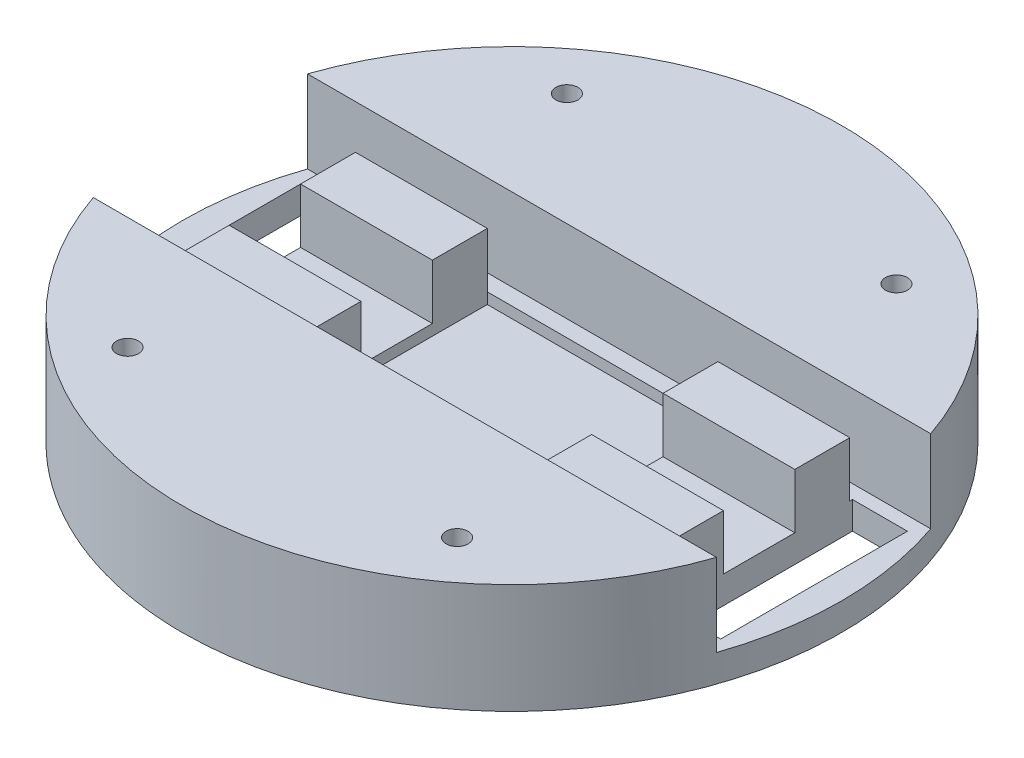
ISO-10303-21;
HEADER;
FILE_DESCRIPTION(('STEP AP214'),'2;1');
FILE_NAME('part.step','',(''),(''),'','','');
FILE_SCHEMA(('AUTOMOTIVE_DESIGN { 1 0 10303 214 1 1 1 1 }'));
ENDSEC;
DATA;
#1=APPLICATION_CONTEXT('core data for automotive mechanical design processes');
#2=APPLICATION_PROTOCOL_DEFINITION('international standard','automotive_design',2000,#1);
#3=PRODUCT_CONTEXT('',#1,'mechanical');
#4=PRODUCT('Part','Part','',(#3));
#5=PRODUCT_RELATED_PRODUCT_CATEGORY('part','',(#4));
#6=PRODUCT_DEFINITION_FORMATION('','',#4);
#7=PRODUCT_DEFINITION_CONTEXT('part definition',#1,'design');
#8=PRODUCT_DEFINITION('design','',#6,#7);
#9=PRODUCT_DEFINITION_SHAPE('','',#8);
#10=(LENGTH_UNIT() NAMED_UNIT(*) SI_UNIT(.MILLI.,.METRE.));
#11=(NAMED_UNIT(*) PLANE_ANGLE_UNIT() SI_UNIT($,.RADIAN.));
#12=(NAMED_UNIT(*) SI_UNIT($,.STERADIAN.) SOLID_ANGLE_UNIT());
#13=UNCERTAINTY_MEASURE_WITH_UNIT(LENGTH_MEASURE(1.E-05),#10,'distance_accuracy_value','');
#14=(GEOMETRIC_REPRESENTATION_CONTEXT(3) GLOBAL_UNCERTAINTY_ASSIGNED_CONTEXT((#13)) GLOBAL_UNIT_ASSIGNED_CONTEXT((#10,
#11,#12)) REPRESENTATION_CONTEXT('',''));
#15=CARTESIAN_POINT('',(0.,0.,0.));
#16=DIRECTION('',(0.,0.,1.));
#17=DIRECTION('',(1.,0.,0.));
#18=AXIS2_PLACEMENT_3D('',#15,#16,#17);
#19=CARTESIAN_POINT('',(0.,5.,0.));
#20=DIRECTION('',(0.,1.,0.));
#21=DIRECTION('',(0.,0.,1.));
#22=AXIS2_PLACEMENT_3D('',#19,#20,#21);
#23=PLANE('',#22);
#24=DIRECTION('',(-1.,0.,0.));
#25=VECTOR('',#24,1.);
#26=CARTESIAN_POINT('',(-21.,5.,-16.5));
#27=LINE('',#26,#25);
#28=CARTESIAN_POINT('',(21.,5.,-16.5));
#29=VERTEX_POINT('',#28);
#30=CARTESIAN_POINT('',(-21.,5.,-16.5));
#31=VERTEX_POINT('',#30);
#32=EDGE_CURVE('E285',#29,#31,#27,.T.);
#33=ORIENTED_EDGE('',*,*,#32,.F.);
#34=DIRECTION('',(-1.,0.,0.));
#35=VECTOR('',#34,1.);
#36=CARTESIAN_POINT('',(45.,5.,-16.5));
#37=LINE('',#36,#35);
#38=CARTESIAN_POINT('',(45.,5.,-16.5));
#39=VERTEX_POINT('',#38);
#40=EDGE_CURVE('E545',#39,#29,#37,.T.);
#41=ORIENTED_EDGE('',*,*,#40,.F.);
#42=DIRECTION('',(0.,0.,1.));
#43=VECTOR('',#42,1.);
#44=CARTESIAN_POINT('',(45.,5.,0.));
#45=LINE('',#44,#43);
#46=CARTESIAN_POINT('',(45.,5.,-17.));
#47=VERTEX_POINT('',#46);
#48=EDGE_CURVE('E450',#47,#39,#45,.T.);
#49=ORIENTED_EDGE('',*,*,#48,.F.);
#50=DIRECTION('',(-1.,0.,0.));
#51=VECTOR('',#50,1.);
#52=CARTESIAN_POINT('',(0.,5.,-16.9999999999999));
#53=LINE('',#52,#51);
#54=CARTESIAN_POINT('',(55.,5.,-17.));
#55=VERTEX_POINT('',#54);
#56=EDGE_CURVE('E461',#55,#47,#53,.T.);
#57=ORIENTED_EDGE('',*,*,#56,.F.);
#58=DIRECTION('',(0.,0.,-1.));
#59=VECTOR('',#58,1.);
#60=CARTESIAN_POINT('',(55.,5.,0.));
#61=LINE('',#60,#59);
#62=CARTESIAN_POINT('',(55.,5.,17.));
#63=VERTEX_POINT('',#62);
#64=EDGE_CURVE('E458',#63,#55,#61,.T.);
#65=ORIENTED_EDGE('',*,*,#64,.F.);
#66=DIRECTION('',(1.,0.,0.));
#67=VECTOR('',#66,1.);
#68=CARTESIAN_POINT('',(0.,5.,17.));
#69=LINE('',#68,#67);
#70=CARTESIAN_POINT('',(45.,5.,17.));
#71=VERTEX_POINT('',#70);
#72=EDGE_CURVE('E454',#71,#63,#69,.T.);
#73=ORIENTED_EDGE('',*,*,#72,.F.);
#74=CARTESIAN_POINT('',(45.,5.,16.5));
#75=VERTEX_POINT('',#74);
#76=EDGE_CURVE('E409',#75,#71,#45,.T.);
#77=ORIENTED_EDGE('',*,*,#76,.F.);
#78=DIRECTION('',(1.,0.,0.));
#79=VECTOR('',#78,1.);
#80=CARTESIAN_POINT('',(45.,5.,16.5));
#81=LINE('',#80,#79);
#82=CARTESIAN_POINT('',(21.,5.,16.5));
#83=VERTEX_POINT('',#82);
#84=EDGE_CURVE('E297',#83,#75,#81,.T.);
#85=ORIENTED_EDGE('',*,*,#84,.F.);
#86=DIRECTION('',(1.,0.,0.));
#87=VECTOR('',#86,1.);
#88=CARTESIAN_POINT('',(-21.,5.,16.5));
#89=LINE('',#88,#87);
#90=CARTESIAN_POINT('',(-21.,5.,16.5));
#91=VERTEX_POINT('',#90);
#92=EDGE_CURVE('E286',#91,#83,#89,.T.);
#93=ORIENTED_EDGE('',*,*,#92,.F.);
#94=DIRECTION('',(1.,0.,0.));
#95=VECTOR('',#94,1.);
#96=CARTESIAN_POINT('',(-45.,5.,16.5));
#97=LINE('',#96,#95);
#98=CARTESIAN_POINT('',(-45.,5.,16.5));
#99=VERTEX_POINT('',#98);
#100=EDGE_CURVE('E349',#99,#91,#97,.T.);
#101=ORIENTED_EDGE('',*,*,#100,.F.);
#102=DIRECTION('',(0.,0.,-1.));
#103=VECTOR('',#102,1.);
#104=CARTESIAN_POINT('',(-45.,5.,0.));
#105=LINE('',#104,#103);
#106=CARTESIAN_POINT('',(-45.,5.,17.));
#107=VERTEX_POINT('',#106);
#108=EDGE_CURVE('E475',#107,#99,#105,.T.);
#109=ORIENTED_EDGE('',*,*,#108,.F.);
#110=DIRECTION('',(1.,0.,0.));
#111=VECTOR('',#110,1.);
#112=CARTESIAN_POINT('',(0.,5.,17.));
#113=LINE('',#112,#111);
#114=CARTESIAN_POINT('',(-55.,5.,17.));
#115=VERTEX_POINT('',#114);
#116=EDGE_CURVE('E471',#115,#107,#113,.T.);
#117=ORIENTED_EDGE('',*,*,#116,.F.);
#118=DIRECTION('',(0.,0.,1.));
#119=VECTOR('',#118,1.);
#120=CARTESIAN_POINT('',(-55.,5.,0.));
#121=LINE('',#120,#119);
#122=CARTESIAN_POINT('',(-55.,5.,-17.));
#123=VERTEX_POINT('',#122);
#124=EDGE_CURVE('E468',#123,#115,#121,.T.);
#125=ORIENTED_EDGE('',*,*,#124,.F.);
#126=DIRECTION('',(-1.,0.,0.));
#127=VECTOR('',#126,1.);
#128=CARTESIAN_POINT('',(0.,5.,-17.));
#129=LINE('',#128,#127);
#130=CARTESIAN_POINT('',(-45.,5.,-17.));
#131=VERTEX_POINT('',#130);
#132=EDGE_CURVE('E465',#131,#123,#129,.T.);
#133=ORIENTED_EDGE('',*,*,#132,.F.);
#134=CARTESIAN_POINT('',(-45.,5.,-16.5));
#135=VERTEX_POINT('',#134);
#136=EDGE_CURVE('E474',#135,#131,#105,.T.);
#137=ORIENTED_EDGE('',*,*,#136,.F.);
#138=DIRECTION('',(-1.,0.,0.));
#139=VECTOR('',#138,1.);
#140=CARTESIAN_POINT('',(-45.,5.,-16.5));
#141=LINE('',#140,#139);
#142=EDGE_CURVE('E320',#31,#135,#141,.T.);
#143=ORIENTED_EDGE('',*,*,#142,.F.);
#144=EDGE_LOOP('',(#33,#41,#49,#57,#65,#73,#77,#85,#93,#101,#109,#117,#125,#133,#137,#143));
#145=FACE_BOUND('',#144,.T.);
#146=CARTESIAN_POINT('',(0.,5.,0.));
#147=DIRECTION('',(0.,1.,0.));
#148=DIRECTION('',(0.,0.,1.));
#149=AXIS2_PLACEMENT_3D('',#146,#147,#148);
#150=CIRCLE('',#149,60.);
#151=CARTESIAN_POINT('',(-56.7428409581332,5.,-19.5));
#152=VERTEX_POINT('',#151);
#153=CARTESIAN_POINT('',(-56.7428409581332,5.,19.5));
#154=VERTEX_POINT('',#153);
#155=EDGE_CURVE('E11',#152,#154,#150,.T.);
#156=ORIENTED_EDGE('',*,*,#155,.T.);
#157=DIRECTION('',(-1.,0.,0.));
#158=VECTOR('',#157,1.);
#159=CARTESIAN_POINT('',(-56.7428409581332,5.,19.5));
#160=LINE('',#159,#158);
#161=CARTESIAN_POINT('',(56.7428409581332,5.,19.5));
#162=VERTEX_POINT('',#161);
#163=EDGE_CURVE('E678',#162,#154,#160,.T.);
#164=ORIENTED_EDGE('',*,*,#163,.F.);
#165=CARTESIAN_POINT('',(56.7428409581332,5.,-19.5));
#166=VERTEX_POINT('',#165);
#167=EDGE_CURVE('E49',#162,#166,#150,.T.);
#168=ORIENTED_EDGE('',*,*,#167,.T.);
#169=DIRECTION('',(1.,0.,0.));
#170=VECTOR('',#169,1.);
#171=CARTESIAN_POINT('',(-56.7428409581332,5.,-19.5));
#172=LINE('',#171,#170);
#173=EDGE_CURVE('E659',#152,#166,#172,.T.);
#174=ORIENTED_EDGE('',*,*,#173,.F.);
#175=EDGE_LOOP('',(#156,#164,#168,#174));
#176=FACE_BOUND('',#175,.T.);
#177=ADVANCED_FACE('F39',(#145,#176),#23,.T.);
#178=DIRECTION('',(0.,0.,1.));
#179=VECTOR('',#178,1.);
#180=CARTESIAN_POINT('',(-21.,5.,-16.5));
#181=LINE('',#180,#179);
#182=CARTESIAN_POINT('',(-21.,5.,-6.5));
#183=VERTEX_POINT('',#182);
#184=CARTESIAN_POINT('',(-21.,5.,6.5));
#185=VERTEX_POINT('',#184);
#186=EDGE_CURVE('E530',#183,#185,#181,.T.);
#187=ORIENTED_EDGE('',*,*,#186,.F.);
#188=DIRECTION('',(1.,0.,0.));
#189=VECTOR('',#188,1.);
#190=CARTESIAN_POINT('',(-45.,5.,-6.5));
#191=LINE('',#190,#189);
#192=CARTESIAN_POINT('',(-45.,5.,-6.5));
#193=VERTEX_POINT('',#192);
#194=EDGE_CURVE('E308',#193,#183,#191,.T.);
#195=ORIENTED_EDGE('',*,*,#194,.F.);
#196=CARTESIAN_POINT('',(-45.,5.,6.5));
#197=VERTEX_POINT('',#196);
#198=EDGE_CURVE('E478',#197,#193,#105,.T.);
#199=ORIENTED_EDGE('',*,*,#198,.F.);
#200=DIRECTION('',(-1.,0.,0.));
#201=VECTOR('',#200,1.);
#202=CARTESIAN_POINT('',(-45.,5.,6.5));
#203=LINE('',#202,#201);
#204=EDGE_CURVE('E355',#185,#197,#203,.T.);
#205=ORIENTED_EDGE('',*,*,#204,.F.);
#206=EDGE_LOOP('',(#187,#195,#199,#205));
#207=FACE_BOUND('',#206,.T.);
#208=ADVANCED_FACE('F252',(#207),#23,.T.);
#209=DIRECTION('',(0.,0.,-1.));
#210=VECTOR('',#209,1.);
#211=CARTESIAN_POINT('',(21.,5.,-16.5));
#212=LINE('',#211,#210);
#213=CARTESIAN_POINT('',(21.,5.,6.5));
#214=VERTEX_POINT('',#213);
#215=CARTESIAN_POINT('',(21.,5.,-6.5));
#216=VERTEX_POINT('',#215);
#217=EDGE_CURVE('E274',#214,#216,#212,.T.);
#218=ORIENTED_EDGE('',*,*,#217,.F.);
#219=DIRECTION('',(-1.,0.,0.));
#220=VECTOR('',#219,1.);
#221=CARTESIAN_POINT('',(45.,5.,6.49999999999999));
#222=LINE('',#221,#220);
#223=CARTESIAN_POINT('',(45.,5.,6.49999999999999));
#224=VERTEX_POINT('',#223);
#225=EDGE_CURVE('E277',#224,#214,#222,.T.);
#226=ORIENTED_EDGE('',*,*,#225,.F.);
#227=CARTESIAN_POINT('',(45.,5.,-6.49999999999999));
#228=VERTEX_POINT('',#227);
#229=EDGE_CURVE('E455',#228,#224,#45,.T.);
#230=ORIENTED_EDGE('',*,*,#229,.F.);
#231=DIRECTION('',(1.,0.,0.));
#232=VECTOR('',#231,1.);
#233=CARTESIAN_POINT('',(45.,5.,-6.49999999999999));
#234=LINE('',#233,#232);
#235=EDGE_CURVE('E279',#216,#228,#234,.T.);
#236=ORIENTED_EDGE('',*,*,#235,.F.);
#237=EDGE_LOOP('',(#218,#226,#230,#236));
#238=FACE_BOUND('',#237,.T.);
#239=ADVANCED_FACE('F255',(#238),#23,.T.);
#240=CARTESIAN_POINT('',(0.,5.,0.));
#241=DIRECTION('',(0.,-1.,0.));
#242=DIRECTION('',(0.,0.,-1.));
#243=AXIS2_PLACEMENT_3D('',#240,#241,#242);
#244=CYLINDRICAL_SURFACE('',#243,60.);
#245=ORIENTED_EDGE('',*,*,#155,.F.);
#246=DIRECTION('',(0.,-1.,0.));
#247=VECTOR('',#246,1.);
#248=CARTESIAN_POINT('',(-56.7428409581332,20.,-19.5));
#249=LINE('',#248,#247);
#250=CARTESIAN_POINT('',(-56.7428409581332,20.,-19.5));
#251=VERTEX_POINT('',#250);
#252=EDGE_CURVE('E637',#251,#152,#249,.T.);
#253=ORIENTED_EDGE('',*,*,#252,.F.);
#254=CARTESIAN_POINT('',(0.,20.,0.));
#255=DIRECTION('',(0.,1.,0.));
#256=DIRECTION('',(0.,0.,-1.));
#257=AXIS2_PLACEMENT_3D('',#254,#255,#256);
#258=CIRCLE('',#257,60.);
#259=CARTESIAN_POINT('',(56.7428409581332,20.,-19.5));
#260=VERTEX_POINT('',#259);
#261=EDGE_CURVE('E663',#260,#251,#258,.T.);
#262=ORIENTED_EDGE('',*,*,#261,.F.);
#263=DIRECTION('',(0.,-1.,0.));
#264=VECTOR('',#263,1.);
#265=CARTESIAN_POINT('',(56.7428409581332,20.,-19.5));
#266=LINE('',#265,#264);
#267=EDGE_CURVE('E654',#260,#166,#266,.T.);
#268=ORIENTED_EDGE('',*,*,#267,.T.);
#269=ORIENTED_EDGE('',*,*,#167,.F.);
#270=DIRECTION('',(0.,-1.,0.));
#271=VECTOR('',#270,1.);
#272=CARTESIAN_POINT('',(56.7428409581332,20.,19.5));
#273=LINE('',#272,#271);
#274=CARTESIAN_POINT('',(56.7428409581332,20.,19.5));
#275=VERTEX_POINT('',#274);
#276=EDGE_CURVE('E664',#275,#162,#273,.T.);
#277=ORIENTED_EDGE('',*,*,#276,.F.);
#278=CARTESIAN_POINT('',(0.,20.,0.));
#279=DIRECTION('',(0.,1.,0.));
#280=DIRECTION('',(0.,0.,1.));
#281=AXIS2_PLACEMENT_3D('',#278,#279,#280);
#282=CIRCLE('',#281,60.);
#283=CARTESIAN_POINT('',(-56.7428409581332,20.,19.5));
#284=VERTEX_POINT('',#283);
#285=EDGE_CURVE('E681',#284,#275,#282,.T.);
#286=ORIENTED_EDGE('',*,*,#285,.F.);
#287=DIRECTION('',(0.,-1.,0.));
#288=VECTOR('',#287,1.);
#289=CARTESIAN_POINT('',(-56.7428409581332,20.,19.5));
#290=LINE('',#289,#288);
#291=EDGE_CURVE('E673',#284,#154,#290,.T.);
#292=ORIENTED_EDGE('',*,*,#291,.T.);
#293=EDGE_LOOP('',(#245,#253,#262,#268,#269,#277,#286,#292));
#294=FACE_BOUND('',#293,.T.);
#295=CARTESIAN_POINT('',(0.,0.,0.));
#296=DIRECTION('',(0.,1.,0.));
#297=DIRECTION('',(0.,0.,1.));
#298=AXIS2_PLACEMENT_3D('',#295,#296,#297);
#299=CIRCLE('',#298,60.);
#300=CARTESIAN_POINT('',(0.,0.,60.));
#301=VERTEX_POINT('',#300);
#302=EDGE_CURVE('E43',#301,#301,#299,.T.);
#303=ORIENTED_EDGE('',*,*,#302,.T.);
#304=EDGE_LOOP('',(#303));
#305=FACE_BOUND('',#304,.T.);
#306=ADVANCED_FACE('F41',(#294,#305),#244,.T.);
#307=CARTESIAN_POINT('',(0.,0.,0.));
#308=DIRECTION('',(0.,1.,0.));
#309=DIRECTION('',(0.,0.,1.));
#310=AXIS2_PLACEMENT_3D('',#307,#308,#309);
#311=PLANE('',#310);
#312=DIRECTION('',(1.,0.,0.));
#313=VECTOR('',#312,1.);
#314=CARTESIAN_POINT('',(-45.,0.,17.));
#315=LINE('',#314,#313);
#316=CARTESIAN_POINT('',(-55.,0.,17.));
#317=VERTEX_POINT('',#316);
#318=CARTESIAN_POINT('',(-45.,0.,17.));
#319=VERTEX_POINT('',#318);
#320=EDGE_CURVE('E400',#317,#319,#315,.T.);
#321=ORIENTED_EDGE('',*,*,#320,.T.);
#322=DIRECTION('',(0.,0.,-1.));
#323=VECTOR('',#322,1.);
#324=CARTESIAN_POINT('',(-45.,0.,-17.));
#325=LINE('',#324,#323);
#326=CARTESIAN_POINT('',(-45.,0.,-17.));
#327=VERTEX_POINT('',#326);
#328=EDGE_CURVE('E387',#319,#327,#325,.T.);
#329=ORIENTED_EDGE('',*,*,#328,.T.);
#330=DIRECTION('',(-1.,0.,0.));
#331=VECTOR('',#330,1.);
#332=CARTESIAN_POINT('',(-45.,0.,-17.));
#333=LINE('',#332,#331);
#334=CARTESIAN_POINT('',(-55.,0.,-17.));
#335=VERTEX_POINT('',#334);
#336=EDGE_CURVE('E391',#327,#335,#333,.T.);
#337=ORIENTED_EDGE('',*,*,#336,.T.);
#338=DIRECTION('',(0.,0.,1.));
#339=VECTOR('',#338,1.);
#340=CARTESIAN_POINT('',(-55.,0.,-17.));
#341=LINE('',#340,#339);
#342=EDGE_CURVE('E396',#335,#317,#341,.T.);
#343=ORIENTED_EDGE('',*,*,#342,.T.);
#344=EDGE_LOOP('',(#321,#329,#337,#343));
#345=FACE_BOUND('',#344,.T.);
#346=DIRECTION('',(0.,0.,-1.));
#347=VECTOR('',#346,1.);
#348=CARTESIAN_POINT('',(55.,0.,-17.));
#349=LINE('',#348,#347);
#350=CARTESIAN_POINT('',(55.,0.,17.));
#351=VERTEX_POINT('',#350);
#352=CARTESIAN_POINT('',(55.,0.,-17.));
#353=VERTEX_POINT('',#352);
#354=EDGE_CURVE('E432',#351,#353,#349,.T.);
#355=ORIENTED_EDGE('',*,*,#354,.T.);
#356=DIRECTION('',(-1.,0.,0.));
#357=VECTOR('',#356,1.);
#358=CARTESIAN_POINT('',(45.,0.,-17.));
#359=LINE('',#358,#357);
#360=CARTESIAN_POINT('',(45.,0.,-17.));
#361=VERTEX_POINT('',#360);
#362=EDGE_CURVE('E386',#353,#361,#359,.T.);
#363=ORIENTED_EDGE('',*,*,#362,.T.);
#364=DIRECTION('',(0.,0.,1.));
#365=VECTOR('',#364,1.);
#366=CARTESIAN_POINT('',(45.,0.,-17.));
#367=LINE('',#366,#365);
#368=CARTESIAN_POINT('',(45.,0.,17.));
#369=VERTEX_POINT('',#368);
#370=EDGE_CURVE('E424',#361,#369,#367,.T.);
#371=ORIENTED_EDGE('',*,*,#370,.T.);
#372=DIRECTION('',(1.,0.,0.));
#373=VECTOR('',#372,1.);
#374=CARTESIAN_POINT('',(45.,0.,17.));
#375=LINE('',#374,#373);
#376=EDGE_CURVE('E428',#369,#351,#375,.T.);
#377=ORIENTED_EDGE('',*,*,#376,.T.);
#378=EDGE_LOOP('',(#355,#363,#371,#377));
#379=FACE_BOUND('',#378,.T.);
#380=ORIENTED_EDGE('',*,*,#302,.F.);
#381=CARTESIAN_POINT('',(0.,0.,39.75));
#382=DIRECTION('',(0.,1.,0.));
#383=DIRECTION('',(0.,0.,1.));
#384=AXIS2_PLACEMENT_3D('',#381,#382,#383);
#385=CIRCLE('',#384,20.25);
#386=EDGE_CURVE('E54',#301,#301,#385,.T.);
#387=ORIENTED_EDGE('',*,*,#386,.T.);
#388=EDGE_LOOP('',(#380,#387));
#389=FACE_BOUND('',#388,.T.);
#390=ADVANCED_FACE('F270',(#345,#379,#389),#311,.F.);
#391=CARTESIAN_POINT('',(45.,0.,-17.));
#392=DIRECTION('',(0.,0.,-1.));
#393=DIRECTION('',(-1.,0.,0.));
#394=AXIS2_PLACEMENT_3D('',#391,#392,#393);
#395=PLANE('',#394);
#396=ORIENTED_EDGE('',*,*,#56,.T.);
#397=DIRECTION('',(0.,1.,0.));
#398=VECTOR('',#397,1.);
#399=CARTESIAN_POINT('',(45.,0.,-17.));
#400=LINE('',#399,#398);
#401=EDGE_CURVE('E436',#361,#47,#400,.T.);
#402=ORIENTED_EDGE('',*,*,#401,.F.);
#403=ORIENTED_EDGE('',*,*,#362,.F.);
#404=DIRECTION('',(0.,1.,0.));
#405=VECTOR('',#404,1.);
#406=CARTESIAN_POINT('',(55.,0.,-17.));
#407=LINE('',#406,#405);
#408=EDGE_CURVE('E392',#353,#55,#407,.T.);
#409=ORIENTED_EDGE('',*,*,#408,.T.);
#410=EDGE_LOOP('',(#396,#402,#403,#409));
#411=FACE_BOUND('',#410,.T.);
#412=ADVANCED_FACE('F724',(#411),#395,.F.);
#413=CARTESIAN_POINT('',(55.,0.,-17.));
#414=DIRECTION('',(1.,0.,0.));
#415=DIRECTION('',(0.,0.,-1.));
#416=AXIS2_PLACEMENT_3D('',#413,#414,#415);
#417=PLANE('',#416);
#418=ORIENTED_EDGE('',*,*,#64,.T.);
#419=ORIENTED_EDGE('',*,*,#408,.F.);
#420=ORIENTED_EDGE('',*,*,#354,.F.);
#421=DIRECTION('',(0.,1.,0.));
#422=VECTOR('',#421,1.);
#423=CARTESIAN_POINT('',(55.,0.,17.));
#424=LINE('',#423,#422);
#425=EDGE_CURVE('E440',#351,#63,#424,.T.);
#426=ORIENTED_EDGE('',*,*,#425,.T.);
#427=EDGE_LOOP('',(#418,#419,#420,#426));
#428=FACE_BOUND('',#427,.T.);
#429=ADVANCED_FACE('F727',(#428),#417,.F.);
#430=CARTESIAN_POINT('',(45.,0.,17.));
#431=DIRECTION('',(0.,0.,1.));
#432=DIRECTION('',(1.,0.,0.));
#433=AXIS2_PLACEMENT_3D('',#430,#431,#432);
#434=PLANE('',#433);
#435=ORIENTED_EDGE('',*,*,#72,.T.);
#436=ORIENTED_EDGE('',*,*,#425,.F.);
#437=ORIENTED_EDGE('',*,*,#376,.F.);
#438=DIRECTION('',(0.,1.,0.));
#439=VECTOR('',#438,1.);
#440=CARTESIAN_POINT('',(45.,0.,17.));
#441=LINE('',#440,#439);
#442=EDGE_CURVE('E444',#369,#71,#441,.T.);
#443=ORIENTED_EDGE('',*,*,#442,.T.);
#444=EDGE_LOOP('',(#435,#436,#437,#443));
#445=FACE_BOUND('',#444,.T.);
#446=ADVANCED_FACE('F732',(#445),#434,.F.);
#447=CARTESIAN_POINT('',(45.,0.,-17.));
#448=DIRECTION('',(-1.,0.,0.));
#449=DIRECTION('',(0.,0.,1.));
#450=AXIS2_PLACEMENT_3D('',#447,#448,#449);
#451=PLANE('',#450);
#452=ORIENTED_EDGE('',*,*,#48,.T.);
#453=DIRECTION('',(0.,-1.,0.));
#454=VECTOR('',#453,1.);
#455=CARTESIAN_POINT('',(45.,15.,-16.5));
#456=LINE('',#455,#454);
#457=CARTESIAN_POINT('',(45.,15.,-16.5));
#458=VERTEX_POINT('',#457);
#459=EDGE_CURVE('E298',#458,#39,#456,.T.);
#460=ORIENTED_EDGE('',*,*,#459,.F.);
#461=DIRECTION('',(0.,0.,-1.));
#462=VECTOR('',#461,1.);
#463=CARTESIAN_POINT('',(45.,15.,-16.5));
#464=LINE('',#463,#462);
#465=CARTESIAN_POINT('',(45.,15.,-6.49999999999999));
#466=VERTEX_POINT('',#465);
#467=EDGE_CURVE('E605',#466,#458,#464,.T.);
#468=ORIENTED_EDGE('',*,*,#467,.F.);
#469=DIRECTION('',(0.,-1.,0.));
#470=VECTOR('',#469,1.);
#471=CARTESIAN_POINT('',(45.,15.,-6.49999999999999));
#472=LINE('',#471,#470);
#473=EDGE_CURVE('E570',#466,#228,#472,.T.);
#474=ORIENTED_EDGE('',*,*,#473,.T.);
#475=ORIENTED_EDGE('',*,*,#229,.T.);
#476=DIRECTION('',(0.,-1.,0.));
#477=VECTOR('',#476,1.);
#478=CARTESIAN_POINT('',(45.,15.,6.49999999999999));
#479=LINE('',#478,#477);
#480=CARTESIAN_POINT('',(45.,15.,6.49999999999999));
#481=VERTEX_POINT('',#480);
#482=EDGE_CURVE('E295',#481,#224,#479,.T.);
#483=ORIENTED_EDGE('',*,*,#482,.F.);
#484=DIRECTION('',(0.,0.,-1.));
#485=VECTOR('',#484,1.);
#486=CARTESIAN_POINT('',(45.,15.,6.49999999999999));
#487=LINE('',#486,#485);
#488=CARTESIAN_POINT('',(45.,15.,16.5));
#489=VERTEX_POINT('',#488);
#490=EDGE_CURVE('E574',#489,#481,#487,.T.);
#491=ORIENTED_EDGE('',*,*,#490,.F.);
#492=DIRECTION('',(0.,-1.,0.));
#493=VECTOR('',#492,1.);
#494=CARTESIAN_POINT('',(45.,15.,16.5));
#495=LINE('',#494,#493);
#496=EDGE_CURVE('E311',#489,#75,#495,.T.);
#497=ORIENTED_EDGE('',*,*,#496,.T.);
#498=ORIENTED_EDGE('',*,*,#76,.T.);
#499=ORIENTED_EDGE('',*,*,#442,.F.);
#500=ORIENTED_EDGE('',*,*,#370,.F.);
#501=ORIENTED_EDGE('',*,*,#401,.T.);
#502=EDGE_LOOP('',(#452,#460,#468,#474,#475,#483,#491,#497,#498,#499,#500,#501));
#503=FACE_BOUND('',#502,.T.);
#504=ADVANCED_FACE('F592',(#503),#451,.F.);
#505=CARTESIAN_POINT('',(-45.,0.,-17.));
#506=DIRECTION('',(1.,0.,0.));
#507=DIRECTION('',(0.,0.,-1.));
#508=AXIS2_PLACEMENT_3D('',#505,#506,#507);
#509=PLANE('',#508);
#510=ORIENTED_EDGE('',*,*,#108,.T.);
#511=DIRECTION('',(0.,-1.,0.));
#512=VECTOR('',#511,1.);
#513=CARTESIAN_POINT('',(-45.,15.,16.5));
#514=LINE('',#513,#512);
#515=CARTESIAN_POINT('',(-45.,15.,16.5));
#516=VERTEX_POINT('',#515);
#517=EDGE_CURVE('E382',#516,#99,#514,.T.);
#518=ORIENTED_EDGE('',*,*,#517,.F.);
#519=DIRECTION('',(0.,0.,1.));
#520=VECTOR('',#519,1.);
#521=CARTESIAN_POINT('',(-45.,15.,6.5));
#522=LINE('',#521,#520);
#523=CARTESIAN_POINT('',(-45.,15.,6.5));
#524=VERTEX_POINT('',#523);
#525=EDGE_CURVE('E350',#524,#516,#522,.T.);
#526=ORIENTED_EDGE('',*,*,#525,.F.);
#527=DIRECTION('',(0.,-1.,0.));
#528=VECTOR('',#527,1.);
#529=CARTESIAN_POINT('',(-45.,15.,6.5));
#530=LINE('',#529,#528);
#531=EDGE_CURVE('E364',#524,#197,#530,.T.);
#532=ORIENTED_EDGE('',*,*,#531,.T.);
#533=ORIENTED_EDGE('',*,*,#198,.T.);
#534=DIRECTION('',(0.,-1.,0.));
#535=VECTOR('',#534,1.);
#536=CARTESIAN_POINT('',(-45.,15.,-6.5));
#537=LINE('',#536,#535);
#538=CARTESIAN_POINT('',(-45.,15.,-6.5));
#539=VERTEX_POINT('',#538);
#540=EDGE_CURVE('E346',#539,#193,#537,.T.);
#541=ORIENTED_EDGE('',*,*,#540,.F.);
#542=DIRECTION('',(0.,0.,1.));
#543=VECTOR('',#542,1.);
#544=CARTESIAN_POINT('',(-45.,15.,-16.5));
#545=LINE('',#544,#543);
#546=CARTESIAN_POINT('',(-45.,15.,-16.5));
#547=VERTEX_POINT('',#546);
#548=EDGE_CURVE('E315',#547,#539,#545,.T.);
#549=ORIENTED_EDGE('',*,*,#548,.F.);
#550=DIRECTION('',(0.,-1.,0.));
#551=VECTOR('',#550,1.);
#552=CARTESIAN_POINT('',(-45.,15.,-16.5));
#553=LINE('',#552,#551);
#554=EDGE_CURVE('E329',#547,#135,#553,.T.);
#555=ORIENTED_EDGE('',*,*,#554,.T.);
#556=ORIENTED_EDGE('',*,*,#136,.T.);
#557=DIRECTION('',(0.,1.,0.));
#558=VECTOR('',#557,1.);
#559=CARTESIAN_POINT('',(-45.,0.,-17.));
#560=LINE('',#559,#558);
#561=EDGE_CURVE('E404',#327,#131,#560,.T.);
#562=ORIENTED_EDGE('',*,*,#561,.F.);
#563=ORIENTED_EDGE('',*,*,#328,.F.);
#564=DIRECTION('',(0.,1.,0.));
#565=VECTOR('',#564,1.);
#566=CARTESIAN_POINT('',(-45.,0.,17.));
#567=LINE('',#566,#565);
#568=EDGE_CURVE('E405',#319,#107,#567,.T.);
#569=ORIENTED_EDGE('',*,*,#568,.T.);
#570=EDGE_LOOP('',(#510,#518,#526,#532,#533,#541,#549,#555,#556,#562,#563,#569));
#571=FACE_BOUND('',#570,.T.);
#572=ADVANCED_FACE('F488',(#571),#509,.F.);
#573=CARTESIAN_POINT('',(-45.,0.,17.));
#574=DIRECTION('',(0.,0.,1.));
#575=DIRECTION('',(1.,0.,0.));
#576=AXIS2_PLACEMENT_3D('',#573,#574,#575);
#577=PLANE('',#576);
#578=ORIENTED_EDGE('',*,*,#116,.T.);
#579=ORIENTED_EDGE('',*,*,#568,.F.);
#580=ORIENTED_EDGE('',*,*,#320,.F.);
#581=DIRECTION('',(0.,1.,0.));
#582=VECTOR('',#581,1.);
#583=CARTESIAN_POINT('',(-55.,0.,17.));
#584=LINE('',#583,#582);
#585=EDGE_CURVE('E410',#317,#115,#584,.T.);
#586=ORIENTED_EDGE('',*,*,#585,.T.);
#587=EDGE_LOOP('',(#578,#579,#580,#586));
#588=FACE_BOUND('',#587,.T.);
#589=ADVANCED_FACE('F504',(#588),#577,.F.);
#590=CARTESIAN_POINT('',(-55.,0.,-17.));
#591=DIRECTION('',(-1.,0.,0.));
#592=DIRECTION('',(0.,0.,1.));
#593=AXIS2_PLACEMENT_3D('',#590,#591,#592);
#594=PLANE('',#593);
#595=ORIENTED_EDGE('',*,*,#124,.T.);
#596=ORIENTED_EDGE('',*,*,#585,.F.);
#597=ORIENTED_EDGE('',*,*,#342,.F.);
#598=DIRECTION('',(0.,1.,0.));
#599=VECTOR('',#598,1.);
#600=CARTESIAN_POINT('',(-55.,0.,-17.));
#601=LINE('',#600,#599);
#602=EDGE_CURVE('E414',#335,#123,#601,.T.);
#603=ORIENTED_EDGE('',*,*,#602,.T.);
#604=EDGE_LOOP('',(#595,#596,#597,#603));
#605=FACE_BOUND('',#604,.T.);
#606=ADVANCED_FACE('F501',(#605),#594,.F.);
#607=CARTESIAN_POINT('',(-45.,0.,-17.));
#608=DIRECTION('',(0.,0.,-1.));
#609=DIRECTION('',(-1.,0.,0.));
#610=AXIS2_PLACEMENT_3D('',#607,#608,#609);
#611=PLANE('',#610);
#612=ORIENTED_EDGE('',*,*,#132,.T.);
#613=ORIENTED_EDGE('',*,*,#602,.F.);
#614=ORIENTED_EDGE('',*,*,#336,.F.);
#615=ORIENTED_EDGE('',*,*,#561,.T.);
#616=EDGE_LOOP('',(#612,#613,#614,#615));
#617=FACE_BOUND('',#616,.T.);
#618=ADVANCED_FACE('F496',(#617),#611,.F.);
#619=CARTESIAN_POINT('',(-45.,15.,16.5));
#620=DIRECTION('',(0.,0.,-1.));
#621=DIRECTION('',(-1.,0.,0.));
#622=AXIS2_PLACEMENT_3D('',#619,#620,#621);
#623=PLANE('',#622);
#624=ORIENTED_EDGE('',*,*,#100,.T.);
#625=DIRECTION('',(0.,-1.,0.));
#626=VECTOR('',#625,1.);
#627=CARTESIAN_POINT('',(-21.,15.,16.5));
#628=LINE('',#627,#626);
#629=CARTESIAN_POINT('',(-21.,15.,16.5));
#630=VERTEX_POINT('',#629);
#631=EDGE_CURVE('E378',#630,#91,#628,.T.);
#632=ORIENTED_EDGE('',*,*,#631,.F.);
#633=DIRECTION('',(1.,0.,0.));
#634=VECTOR('',#633,1.);
#635=CARTESIAN_POINT('',(-45.,15.,16.5));
#636=LINE('',#635,#634);
#637=EDGE_CURVE('E354',#516,#630,#636,.T.);
#638=ORIENTED_EDGE('',*,*,#637,.F.);
#639=ORIENTED_EDGE('',*,*,#517,.T.);
#640=EDGE_LOOP('',(#624,#632,#638,#639));
#641=FACE_BOUND('',#640,.T.);
#642=ADVANCED_FACE('F512',(#641),#623,.F.);
#643=CARTESIAN_POINT('',(-21.,15.,6.5));
#644=DIRECTION('',(-1.,0.,0.));
#645=DIRECTION('',(0.,0.,1.));
#646=AXIS2_PLACEMENT_3D('',#643,#644,#645);
#647=PLANE('',#646);
#648=ORIENTED_EDGE('',*,*,#631,.T.);
#649=DIRECTION('',(0.,1.,0.));
#650=VECTOR('',#649,1.);
#651=CARTESIAN_POINT('',(-21.,3.,16.5));
#652=LINE('',#651,#650);
#653=CARTESIAN_POINT('',(-21.,3.,16.5));
#654=VERTEX_POINT('',#653);
#655=EDGE_CURVE('E517',#654,#91,#652,.T.);
#656=ORIENTED_EDGE('',*,*,#655,.F.);
#657=DIRECTION('',(0.,0.,1.));
#658=VECTOR('',#657,1.);
#659=CARTESIAN_POINT('',(-21.,3.,-16.5));
#660=LINE('',#659,#658);
#661=CARTESIAN_POINT('',(-21.,3.,-16.5));
#662=VERTEX_POINT('',#661);
#663=EDGE_CURVE('E548',#662,#654,#660,.T.);
#664=ORIENTED_EDGE('',*,*,#663,.F.);
#665=DIRECTION('',(0.,1.,0.));
#666=VECTOR('',#665,1.);
#667=CARTESIAN_POINT('',(-21.,3.,-16.5));
#668=LINE('',#667,#666);
#669=EDGE_CURVE('E558',#662,#31,#668,.T.);
#670=ORIENTED_EDGE('',*,*,#669,.T.);
#671=DIRECTION('',(0.,-1.,0.));
#672=VECTOR('',#671,1.);
#673=CARTESIAN_POINT('',(-21.,15.,-16.5));
#674=LINE('',#673,#672);
#675=CARTESIAN_POINT('',(-21.,15.,-16.5));
#676=VERTEX_POINT('',#675);
#677=EDGE_CURVE('E338',#676,#31,#674,.T.);
#678=ORIENTED_EDGE('',*,*,#677,.F.);
#679=DIRECTION('',(0.,0.,-1.));
#680=VECTOR('',#679,1.);
#681=CARTESIAN_POINT('',(-21.,15.,-16.5));
#682=LINE('',#681,#680);
#683=CARTESIAN_POINT('',(-21.,15.,-6.5));
#684=VERTEX_POINT('',#683);
#685=EDGE_CURVE('E323',#684,#676,#682,.T.);
#686=ORIENTED_EDGE('',*,*,#685,.F.);
#687=DIRECTION('',(0.,-1.,0.));
#688=VECTOR('',#687,1.);
#689=CARTESIAN_POINT('',(-21.,15.,-6.5));
#690=LINE('',#689,#688);
#691=EDGE_CURVE('E342',#684,#183,#690,.T.);
#692=ORIENTED_EDGE('',*,*,#691,.T.);
#693=ORIENTED_EDGE('',*,*,#186,.T.);
#694=DIRECTION('',(0.,-1.,0.));
#695=VECTOR('',#694,1.);
#696=CARTESIAN_POINT('',(-21.,15.,6.5));
#697=LINE('',#696,#695);
#698=CARTESIAN_POINT('',(-21.,15.,6.5));
#699=VERTEX_POINT('',#698);
#700=EDGE_CURVE('E374',#699,#185,#697,.T.);
#701=ORIENTED_EDGE('',*,*,#700,.F.);
#702=DIRECTION('',(0.,0.,-1.));
#703=VECTOR('',#702,1.);
#704=CARTESIAN_POINT('',(-21.,15.,6.5));
#705=LINE('',#704,#703);
#706=EDGE_CURVE('E358',#630,#699,#705,.T.);
#707=ORIENTED_EDGE('',*,*,#706,.F.);
#708=EDGE_LOOP('',(#648,#656,#664,#670,#678,#686,#692,#693,#701,#707));
#709=FACE_BOUND('',#708,.T.);
#710=ADVANCED_FACE('F515',(#709),#647,.F.);
#711=CARTESIAN_POINT('',(-45.,15.,6.5));
#712=DIRECTION('',(0.,0.,1.));
#713=DIRECTION('',(1.,0.,0.));
#714=AXIS2_PLACEMENT_3D('',#711,#712,#713);
#715=PLANE('',#714);
#716=ORIENTED_EDGE('',*,*,#204,.T.);
#717=ORIENTED_EDGE('',*,*,#531,.F.);
#718=DIRECTION('',(-1.,0.,0.));
#719=VECTOR('',#718,1.);
#720=CARTESIAN_POINT('',(-45.,15.,6.5));
#721=LINE('',#720,#719);
#722=EDGE_CURVE('E361',#699,#524,#721,.T.);
#723=ORIENTED_EDGE('',*,*,#722,.F.);
#724=ORIENTED_EDGE('',*,*,#700,.T.);
#725=EDGE_LOOP('',(#716,#717,#723,#724));
#726=FACE_BOUND('',#725,.T.);
#727=ADVANCED_FACE('F527',(#726),#715,.F.);
#728=CARTESIAN_POINT('',(0.,15.,0.));
#729=DIRECTION('',(0.,1.,0.));
#730=DIRECTION('',(0.,0.,1.));
#731=AXIS2_PLACEMENT_3D('',#728,#729,#730);
#732=PLANE('',#731);
#733=ORIENTED_EDGE('',*,*,#525,.T.);
#734=ORIENTED_EDGE('',*,*,#637,.T.);
#735=ORIENTED_EDGE('',*,*,#706,.T.);
#736=ORIENTED_EDGE('',*,*,#722,.T.);
#737=EDGE_LOOP('',(#733,#734,#735,#736));
#738=FACE_BOUND('',#737,.T.);
#739=ADVANCED_FACE('F522',(#738),#732,.T.);
#740=CARTESIAN_POINT('',(-45.,15.,-6.5));
#741=DIRECTION('',(0.,0.,-1.));
#742=DIRECTION('',(-1.,0.,0.));
#743=AXIS2_PLACEMENT_3D('',#740,#741,#742);
#744=PLANE('',#743);
#745=ORIENTED_EDGE('',*,*,#194,.T.);
#746=ORIENTED_EDGE('',*,*,#691,.F.);
#747=DIRECTION('',(1.,0.,0.));
#748=VECTOR('',#747,1.);
#749=CARTESIAN_POINT('',(-45.,15.,-6.5));
#750=LINE('',#749,#748);
#751=EDGE_CURVE('E319',#539,#684,#750,.T.);
#752=ORIENTED_EDGE('',*,*,#751,.F.);
#753=ORIENTED_EDGE('',*,*,#540,.T.);
#754=EDGE_LOOP('',(#745,#746,#752,#753));
#755=FACE_BOUND('',#754,.T.);
#756=ADVANCED_FACE('F533',(#755),#744,.F.);
#757=CARTESIAN_POINT('',(-45.,15.,-16.5));
#758=DIRECTION('',(0.,0.,1.));
#759=DIRECTION('',(1.,0.,0.));
#760=AXIS2_PLACEMENT_3D('',#757,#758,#759);
#761=PLANE('',#760);
#762=ORIENTED_EDGE('',*,*,#142,.T.);
#763=ORIENTED_EDGE('',*,*,#554,.F.);
#764=DIRECTION('',(-1.,0.,0.));
#765=VECTOR('',#764,1.);
#766=CARTESIAN_POINT('',(-45.,15.,-16.5));
#767=LINE('',#766,#765);
#768=EDGE_CURVE('E326',#676,#547,#767,.T.);
#769=ORIENTED_EDGE('',*,*,#768,.F.);
#770=ORIENTED_EDGE('',*,*,#677,.T.);
#771=EDGE_LOOP('',(#762,#763,#769,#770));
#772=FACE_BOUND('',#771,.T.);
#773=ADVANCED_FACE('F540',(#772),#761,.F.);
#774=CARTESIAN_POINT('',(0.,15.,0.));
#775=DIRECTION('',(0.,1.,0.));
#776=DIRECTION('',(0.,0.,1.));
#777=AXIS2_PLACEMENT_3D('',#774,#775,#776);
#778=PLANE('',#777);
#779=ORIENTED_EDGE('',*,*,#548,.T.);
#780=ORIENTED_EDGE('',*,*,#751,.T.);
#781=ORIENTED_EDGE('',*,*,#685,.T.);
#782=ORIENTED_EDGE('',*,*,#768,.T.);
#783=EDGE_LOOP('',(#779,#780,#781,#782));
#784=FACE_BOUND('',#783,.T.);
#785=ADVANCED_FACE('F538',(#784),#778,.T.);
#786=CARTESIAN_POINT('',(45.,15.,6.49999999999999));
#787=DIRECTION('',(0.,0.,1.));
#788=DIRECTION('',(1.,0.,0.));
#789=AXIS2_PLACEMENT_3D('',#786,#787,#788);
#790=PLANE('',#789);
#791=ORIENTED_EDGE('',*,*,#225,.T.);
#792=DIRECTION('',(0.,-1.,0.));
#793=VECTOR('',#792,1.);
#794=CARTESIAN_POINT('',(21.,15.,6.5));
#795=LINE('',#794,#793);
#796=CARTESIAN_POINT('',(21.,15.,6.5));
#797=VERTEX_POINT('',#796);
#798=EDGE_CURVE('E292',#797,#214,#795,.T.);
#799=ORIENTED_EDGE('',*,*,#798,.F.);
#800=DIRECTION('',(-1.,0.,0.));
#801=VECTOR('',#800,1.);
#802=CARTESIAN_POINT('',(45.,15.,6.49999999999999));
#803=LINE('',#802,#801);
#804=EDGE_CURVE('E578',#481,#797,#803,.T.);
#805=ORIENTED_EDGE('',*,*,#804,.F.);
#806=ORIENTED_EDGE('',*,*,#482,.T.);
#807=EDGE_LOOP('',(#791,#799,#805,#806));
#808=FACE_BOUND('',#807,.T.);
#809=ADVANCED_FACE('F291',(#808),#790,.F.);
#810=CARTESIAN_POINT('',(21.,15.,6.5));
#811=DIRECTION('',(1.,0.,0.));
#812=DIRECTION('',(0.,0.,-1.));
#813=AXIS2_PLACEMENT_3D('',#810,#811,#812);
#814=PLANE('',#813);
#815=ORIENTED_EDGE('',*,*,#798,.T.);
#816=ORIENTED_EDGE('',*,*,#217,.T.);
#817=DIRECTION('',(0.,-1.,0.));
#818=VECTOR('',#817,1.);
#819=CARTESIAN_POINT('',(21.,15.,-6.5));
#820=LINE('',#819,#818);
#821=CARTESIAN_POINT('',(21.,15.,-6.5));
#822=VERTEX_POINT('',#821);
#823=EDGE_CURVE('E565',#822,#216,#820,.T.);
#824=ORIENTED_EDGE('',*,*,#823,.F.);
#825=DIRECTION('',(0.,0.,1.));
#826=VECTOR('',#825,1.);
#827=CARTESIAN_POINT('',(21.,15.,-16.5));
#828=LINE('',#827,#826);
#829=CARTESIAN_POINT('',(21.,15.,-16.5));
#830=VERTEX_POINT('',#829);
#831=EDGE_CURVE('E563',#830,#822,#828,.T.);
#832=ORIENTED_EDGE('',*,*,#831,.F.);
#833=DIRECTION('',(0.,-1.,0.));
#834=VECTOR('',#833,1.);
#835=CARTESIAN_POINT('',(21.,15.,-16.5));
#836=LINE('',#835,#834);
#837=EDGE_CURVE('E554',#830,#29,#836,.T.);
#838=ORIENTED_EDGE('',*,*,#837,.T.);
#839=DIRECTION('',(0.,1.,0.));
#840=VECTOR('',#839,1.);
#841=CARTESIAN_POINT('',(21.,3.,-16.5));
#842=LINE('',#841,#840);
#843=CARTESIAN_POINT('',(21.,3.,-16.5));
#844=VERTEX_POINT('',#843);
#845=EDGE_CURVE('E561',#844,#29,#842,.T.);
#846=ORIENTED_EDGE('',*,*,#845,.F.);
#847=DIRECTION('',(0.,0.,-1.));
#848=VECTOR('',#847,1.);
#849=CARTESIAN_POINT('',(21.,3.,-16.5));
#850=LINE('',#849,#848);
#851=CARTESIAN_POINT('',(21.,3.,16.5));
#852=VERTEX_POINT('',#851);
#853=EDGE_CURVE('E641',#852,#844,#850,.T.);
#854=ORIENTED_EDGE('',*,*,#853,.F.);
#855=DIRECTION('',(0.,1.,0.));
#856=VECTOR('',#855,1.);
#857=CARTESIAN_POINT('',(21.,3.,16.5));
#858=LINE('',#857,#856);
#859=EDGE_CURVE('E625',#852,#83,#858,.T.);
#860=ORIENTED_EDGE('',*,*,#859,.T.);
#861=DIRECTION('',(0.,-1.,0.));
#862=VECTOR('',#861,1.);
#863=CARTESIAN_POINT('',(21.,15.,16.5));
#864=LINE('',#863,#862);
#865=CARTESIAN_POINT('',(21.,15.,16.5));
#866=VERTEX_POINT('',#865);
#867=EDGE_CURVE('E304',#866,#83,#864,.T.);
#868=ORIENTED_EDGE('',*,*,#867,.F.);
#869=DIRECTION('',(0.,0.,1.));
#870=VECTOR('',#869,1.);
#871=CARTESIAN_POINT('',(21.,15.,6.5));
#872=LINE('',#871,#870);
#873=EDGE_CURVE('E302',#797,#866,#872,.T.);
#874=ORIENTED_EDGE('',*,*,#873,.F.);
#875=EDGE_LOOP('',(#815,#816,#824,#832,#838,#846,#854,#860,#868,#874));
#876=FACE_BOUND('',#875,.T.);
#877=ADVANCED_FACE('F300',(#876),#814,.F.);
#878=CARTESIAN_POINT('',(45.,15.,16.5));
#879=DIRECTION('',(0.,0.,-1.));
#880=DIRECTION('',(-1.,0.,0.));
#881=AXIS2_PLACEMENT_3D('',#878,#879,#880);
#882=PLANE('',#881);
#883=ORIENTED_EDGE('',*,*,#84,.T.);
#884=ORIENTED_EDGE('',*,*,#496,.F.);
#885=DIRECTION('',(1.,0.,0.));
#886=VECTOR('',#885,1.);
#887=CARTESIAN_POINT('',(45.,15.,16.5));
#888=LINE('',#887,#886);
#889=EDGE_CURVE('E583',#866,#489,#888,.T.);
#890=ORIENTED_EDGE('',*,*,#889,.F.);
#891=ORIENTED_EDGE('',*,*,#867,.T.);
#892=EDGE_LOOP('',(#883,#884,#890,#891));
#893=FACE_BOUND('',#892,.T.);
#894=ADVANCED_FACE('F597',(#893),#882,.F.);
#895=CARTESIAN_POINT('',(0.,15.,0.));
#896=DIRECTION('',(0.,-1.,0.));
#897=DIRECTION('',(0.,0.,-1.));
#898=AXIS2_PLACEMENT_3D('',#895,#896,#897);
#899=PLANE('',#898);
#900=ORIENTED_EDGE('',*,*,#490,.T.);
#901=ORIENTED_EDGE('',*,*,#804,.T.);
#902=ORIENTED_EDGE('',*,*,#873,.T.);
#903=ORIENTED_EDGE('',*,*,#889,.T.);
#904=EDGE_LOOP('',(#900,#901,#902,#903));
#905=FACE_BOUND('',#904,.T.);
#906=ADVANCED_FACE('F769',(#905),#899,.F.);
#907=CARTESIAN_POINT('',(45.,15.,-16.5));
#908=DIRECTION('',(0.,0.,1.));
#909=DIRECTION('',(1.,0.,0.));
#910=AXIS2_PLACEMENT_3D('',#907,#908,#909);
#911=PLANE('',#910);
#912=ORIENTED_EDGE('',*,*,#40,.T.);
#913=ORIENTED_EDGE('',*,*,#837,.F.);
#914=DIRECTION('',(-1.,0.,0.));
#915=VECTOR('',#914,1.);
#916=CARTESIAN_POINT('',(45.,15.,-16.5));
#917=LINE('',#916,#915);
#918=EDGE_CURVE('E614',#458,#830,#917,.T.);
#919=ORIENTED_EDGE('',*,*,#918,.F.);
#920=ORIENTED_EDGE('',*,*,#459,.T.);
#921=EDGE_LOOP('',(#912,#913,#919,#920));
#922=FACE_BOUND('',#921,.T.);
#923=ADVANCED_FACE('F553',(#922),#911,.F.);
#924=CARTESIAN_POINT('',(45.,15.,-6.49999999999999));
#925=DIRECTION('',(0.,0.,-1.));
#926=DIRECTION('',(-1.,0.,0.));
#927=AXIS2_PLACEMENT_3D('',#924,#925,#926);
#928=PLANE('',#927);
#929=ORIENTED_EDGE('',*,*,#235,.T.);
#930=ORIENTED_EDGE('',*,*,#473,.F.);
#931=DIRECTION('',(1.,0.,0.));
#932=VECTOR('',#931,1.);
#933=CARTESIAN_POINT('',(45.,15.,-6.49999999999999));
#934=LINE('',#933,#932);
#935=EDGE_CURVE('E609',#822,#466,#934,.T.);
#936=ORIENTED_EDGE('',*,*,#935,.F.);
#937=ORIENTED_EDGE('',*,*,#823,.T.);
#938=EDGE_LOOP('',(#929,#930,#936,#937));
#939=FACE_BOUND('',#938,.T.);
#940=ADVANCED_FACE('F610',(#939),#928,.F.);
#941=CARTESIAN_POINT('',(0.,15.,0.));
#942=DIRECTION('',(0.,-1.,0.));
#943=DIRECTION('',(0.,0.,-1.));
#944=AXIS2_PLACEMENT_3D('',#941,#942,#943);
#945=PLANE('',#944);
#946=ORIENTED_EDGE('',*,*,#467,.T.);
#947=ORIENTED_EDGE('',*,*,#918,.T.);
#948=ORIENTED_EDGE('',*,*,#831,.T.);
#949=ORIENTED_EDGE('',*,*,#935,.T.);
#950=EDGE_LOOP('',(#946,#947,#948,#949));
#951=FACE_BOUND('',#950,.T.);
#952=ADVANCED_FACE('F777',(#951),#945,.F.);
#953=CARTESIAN_POINT('',(-21.,3.,-16.5));
#954=DIRECTION('',(0.,0.,-1.));
#955=DIRECTION('',(-1.,0.,0.));
#956=AXIS2_PLACEMENT_3D('',#953,#954,#955);
#957=PLANE('',#956);
#958=ORIENTED_EDGE('',*,*,#32,.T.);
#959=ORIENTED_EDGE('',*,*,#669,.F.);
#960=DIRECTION('',(-1.,0.,0.));
#961=VECTOR('',#960,1.);
#962=CARTESIAN_POINT('',(-21.,3.,-16.5));
#963=LINE('',#962,#961);
#964=EDGE_CURVE('E626',#844,#662,#963,.T.);
#965=ORIENTED_EDGE('',*,*,#964,.F.);
#966=ORIENTED_EDGE('',*,*,#845,.T.);
#967=EDGE_LOOP('',(#958,#959,#965,#966));
#968=FACE_BOUND('',#967,.T.);
#969=ADVANCED_FACE('F780',(#968),#957,.F.);
#970=CARTESIAN_POINT('',(-21.,3.,16.5));
#971=DIRECTION('',(0.,0.,1.));
#972=DIRECTION('',(1.,0.,0.));
#973=AXIS2_PLACEMENT_3D('',#970,#971,#972);
#974=PLANE('',#973);
#975=ORIENTED_EDGE('',*,*,#92,.T.);
#976=ORIENTED_EDGE('',*,*,#859,.F.);
#977=DIRECTION('',(1.,0.,0.));
#978=VECTOR('',#977,1.);
#979=CARTESIAN_POINT('',(-21.,3.,16.5));
#980=LINE('',#979,#978);
#981=EDGE_CURVE('E644',#654,#852,#980,.T.);
#982=ORIENTED_EDGE('',*,*,#981,.F.);
#983=ORIENTED_EDGE('',*,*,#655,.T.);
#984=EDGE_LOOP('',(#975,#976,#982,#983));
#985=FACE_BOUND('',#984,.T.);
#986=ADVANCED_FACE('F782',(#985),#974,.F.);
#987=CARTESIAN_POINT('',(0.,3.,0.));
#988=DIRECTION('',(0.,1.,0.));
#989=DIRECTION('',(0.,0.,1.));
#990=AXIS2_PLACEMENT_3D('',#987,#988,#989);
#991=PLANE('',#990);
#992=ORIENTED_EDGE('',*,*,#663,.T.);
#993=ORIENTED_EDGE('',*,*,#981,.T.);
#994=ORIENTED_EDGE('',*,*,#853,.T.);
#995=ORIENTED_EDGE('',*,*,#964,.T.);
#996=EDGE_LOOP('',(#992,#993,#994,#995));
#997=FACE_BOUND('',#996,.T.);
#998=ADVANCED_FACE('F785',(#997),#991,.T.);
#999=CARTESIAN_POINT('',(-56.7428409581332,20.,-19.5));
#1000=DIRECTION('',(0.,0.,-1.));
#1001=DIRECTION('',(-1.,0.,0.));
#1002=AXIS2_PLACEMENT_3D('',#999,#1000,#1001);
#1003=PLANE('',#1002);
#1004=ORIENTED_EDGE('',*,*,#173,.T.);
#1005=ORIENTED_EDGE('',*,*,#267,.F.);
#1006=DIRECTION('',(1.,0.,0.));
#1007=VECTOR('',#1006,1.);
#1008=CARTESIAN_POINT('',(-56.7428409581332,20.,-19.5));
#1009=LINE('',#1008,#1007);
#1010=EDGE_CURVE('E658',#251,#260,#1009,.T.);
#1011=ORIENTED_EDGE('',*,*,#1010,.F.);
#1012=ORIENTED_EDGE('',*,*,#252,.T.);
#1013=EDGE_LOOP('',(#1004,#1005,#1011,#1012));
#1014=FACE_BOUND('',#1013,.T.);
#1015=ADVANCED_FACE('F791',(#1014),#1003,.F.);
#1016=CARTESIAN_POINT('',(0.,20.,0.));
#1017=DIRECTION('',(0.,-1.,0.));
#1018=DIRECTION('',(0.,0.,-1.));
#1019=AXIS2_PLACEMENT_3D('',#1016,#1017,#1018);
#1020=PLANE('',#1019);
#1021=CARTESIAN_POINT('',(30.,20.,-40.));
#1022=DIRECTION('',(0.,1.,0.));
#1023=DIRECTION('',(0.,0.,1.));
#1024=AXIS2_PLACEMENT_3D('',#1021,#1022,#1023);
#1025=CIRCLE('',#1024,2.);
#1026=CARTESIAN_POINT('',(30.,20.,-38.));
#1027=VERTEX_POINT('',#1026);
#1028=EDGE_CURVE('E696',#1027,#1027,#1025,.T.);
#1029=ORIENTED_EDGE('',*,*,#1028,.F.);
#1030=EDGE_LOOP('',(#1029));
#1031=FACE_BOUND('',#1030,.T.);
#1032=CARTESIAN_POINT('',(-30.,20.,-40.));
#1033=DIRECTION('',(0.,1.,0.));
#1034=DIRECTION('',(0.,0.,1.));
#1035=AXIS2_PLACEMENT_3D('',#1032,#1033,#1034);
#1036=CIRCLE('',#1035,2.);
#1037=CARTESIAN_POINT('',(-30.,20.,-38.));
#1038=VERTEX_POINT('',#1037);
#1039=EDGE_CURVE('E712',#1038,#1038,#1036,.T.);
#1040=ORIENTED_EDGE('',*,*,#1039,.F.);
#1041=EDGE_LOOP('',(#1040));
#1042=FACE_BOUND('',#1041,.T.);
#1043=ORIENTED_EDGE('',*,*,#261,.T.);
#1044=ORIENTED_EDGE('',*,*,#1010,.T.);
#1045=EDGE_LOOP('',(#1043,#1044));
#1046=FACE_BOUND('',#1045,.T.);
#1047=ADVANCED_FACE('F795',(#1031,#1042,#1046),#1020,.F.);
#1048=CARTESIAN_POINT('',(-56.7428409581332,20.,19.5));
#1049=DIRECTION('',(0.,0.,1.));
#1050=DIRECTION('',(1.,0.,0.));
#1051=AXIS2_PLACEMENT_3D('',#1048,#1049,#1050);
#1052=PLANE('',#1051);
#1053=ORIENTED_EDGE('',*,*,#163,.T.);
#1054=ORIENTED_EDGE('',*,*,#291,.F.);
#1055=DIRECTION('',(-1.,0.,0.));
#1056=VECTOR('',#1055,1.);
#1057=CARTESIAN_POINT('',(-56.7428409581332,20.,19.5));
#1058=LINE('',#1057,#1056);
#1059=EDGE_CURVE('E677',#275,#284,#1058,.T.);
#1060=ORIENTED_EDGE('',*,*,#1059,.F.);
#1061=ORIENTED_EDGE('',*,*,#276,.T.);
#1062=EDGE_LOOP('',(#1053,#1054,#1060,#1061));
#1063=FACE_BOUND('',#1062,.T.);
#1064=ADVANCED_FACE('F799',(#1063),#1052,.F.);
#1065=CARTESIAN_POINT('',(0.,20.,0.));
#1066=DIRECTION('',(0.,1.,0.));
#1067=DIRECTION('',(0.,0.,1.));
#1068=AXIS2_PLACEMENT_3D('',#1065,#1066,#1067);
#1069=PLANE('',#1068);
#1070=CARTESIAN_POINT('',(-30.,20.,40.));
#1071=DIRECTION('',(0.,1.,0.));
#1072=DIRECTION('',(0.,0.,1.));
#1073=AXIS2_PLACEMENT_3D('',#1070,#1071,#1072);
#1074=CIRCLE('',#1073,2.);
#1075=CARTESIAN_POINT('',(-30.,20.,42.));
#1076=VERTEX_POINT('',#1075);
#1077=EDGE_CURVE('E705',#1076,#1076,#1074,.T.);
#1078=ORIENTED_EDGE('',*,*,#1077,.F.);
#1079=EDGE_LOOP('',(#1078));
#1080=FACE_BOUND('',#1079,.T.);
#1081=CARTESIAN_POINT('',(30.,20.,40.));
#1082=DIRECTION('',(0.,1.,0.));
#1083=DIRECTION('',(0.,0.,1.));
#1084=AXIS2_PLACEMENT_3D('',#1081,#1082,#1083);
#1085=CIRCLE('',#1084,2.);
#1086=CARTESIAN_POINT('',(30.,20.,42.));
#1087=VERTEX_POINT('',#1086);
#1088=EDGE_CURVE('E688',#1087,#1087,#1085,.T.);
#1089=ORIENTED_EDGE('',*,*,#1088,.F.);
#1090=EDGE_LOOP('',(#1089));
#1091=FACE_BOUND('',#1090,.T.);
#1092=ORIENTED_EDGE('',*,*,#285,.T.);
#1093=ORIENTED_EDGE('',*,*,#1059,.T.);
#1094=EDGE_LOOP('',(#1092,#1093));
#1095=FACE_BOUND('',#1094,.T.);
#1096=ADVANCED_FACE('F803',(#1080,#1091,#1095),#1069,.T.);
#1097=CARTESIAN_POINT('',(30.,10.,40.));
#1098=DIRECTION('',(0.,1.,0.));
#1099=DIRECTION('',(0.,0.,1.));
#1100=AXIS2_PLACEMENT_3D('',#1097,#1098,#1099);
#1101=CYLINDRICAL_SURFACE('',#1100,2.);
#1102=CARTESIAN_POINT('',(30.,10.,40.));
#1103=DIRECTION('',(0.,1.,0.));
#1104=DIRECTION('',(0.,0.,1.));
#1105=AXIS2_PLACEMENT_3D('',#1102,#1103,#1104);
#1106=CIRCLE('',#1105,2.);
#1107=CARTESIAN_POINT('',(30.,10.,42.));
#1108=VERTEX_POINT('',#1107);
#1109=EDGE_CURVE('E682',#1108,#1108,#1106,.T.);
#1110=ORIENTED_EDGE('',*,*,#1109,.F.);
#1111=EDGE_LOOP('',(#1110));
#1112=FACE_BOUND('',#1111,.T.);
#1113=ORIENTED_EDGE('',*,*,#1088,.T.);
#1114=EDGE_LOOP('',(#1113));
#1115=FACE_BOUND('',#1114,.T.);
#1116=ADVANCED_FACE('F807',(#1112,#1115),#1101,.F.);
#1117=CARTESIAN_POINT('',(30.,10.,40.));
#1118=DIRECTION('',(0.,1.,0.));
#1119=DIRECTION('',(0.,0.,1.));
#1120=AXIS2_PLACEMENT_3D('',#1117,#1118,#1119);
#1121=PLANE('',#1120);
#1122=ORIENTED_EDGE('',*,*,#1109,.T.);
#1123=EDGE_LOOP('',(#1122));
#1124=FACE_BOUND('',#1123,.T.);
#1125=ADVANCED_FACE('F811',(#1124),#1121,.T.);
#1126=CARTESIAN_POINT('',(-30.,10.,40.));
#1127=DIRECTION('',(0.,1.,0.));
#1128=DIRECTION('',(0.,0.,1.));
#1129=AXIS2_PLACEMENT_3D('',#1126,#1127,#1128);
#1130=CYLINDRICAL_SURFACE('',#1129,2.);
#1131=CARTESIAN_POINT('',(-30.,10.,40.));
#1132=DIRECTION('',(0.,1.,0.));
#1133=DIRECTION('',(0.,0.,1.));
#1134=AXIS2_PLACEMENT_3D('',#1131,#1132,#1133);
#1135=CIRCLE('',#1134,2.);
#1136=CARTESIAN_POINT('',(-30.,10.,42.));
#1137=VERTEX_POINT('',#1136);
#1138=EDGE_CURVE('E692',#1137,#1137,#1135,.T.);
#1139=ORIENTED_EDGE('',*,*,#1138,.F.);
#1140=EDGE_LOOP('',(#1139));
#1141=FACE_BOUND('',#1140,.T.);
#1142=ORIENTED_EDGE('',*,*,#1077,.T.);
#1143=EDGE_LOOP('',(#1142));
#1144=FACE_BOUND('',#1143,.T.);
#1145=ADVANCED_FACE('F815',(#1141,#1144),#1130,.F.);
#1146=CARTESIAN_POINT('',(-30.,10.,40.));
#1147=DIRECTION('',(0.,1.,0.));
#1148=DIRECTION('',(0.,0.,1.));
#1149=AXIS2_PLACEMENT_3D('',#1146,#1147,#1148);
#1150=PLANE('',#1149);
#1151=ORIENTED_EDGE('',*,*,#1138,.T.);
#1152=EDGE_LOOP('',(#1151));
#1153=FACE_BOUND('',#1152,.T.);
#1154=ADVANCED_FACE('F823',(#1153),#1150,.T.);
#1155=CARTESIAN_POINT('',(-30.,10.,-40.));
#1156=DIRECTION('',(0.,1.,0.));
#1157=DIRECTION('',(0.,0.,1.));
#1158=AXIS2_PLACEMENT_3D('',#1155,#1156,#1157);
#1159=CYLINDRICAL_SURFACE('',#1158,2.);
#1160=CARTESIAN_POINT('',(-30.,10.,-40.));
#1161=DIRECTION('',(0.,1.,0.));
#1162=DIRECTION('',(0.,0.,1.));
#1163=AXIS2_PLACEMENT_3D('',#1160,#1161,#1162);
#1164=CIRCLE('',#1163,2.);
#1165=CARTESIAN_POINT('',(-30.,10.,-38.));
#1166=VERTEX_POINT('',#1165);
#1167=EDGE_CURVE('E701',#1166,#1166,#1164,.T.);
#1168=ORIENTED_EDGE('',*,*,#1167,.F.);
#1169=EDGE_LOOP('',(#1168));
#1170=FACE_BOUND('',#1169,.T.);
#1171=ORIENTED_EDGE('',*,*,#1039,.T.);
#1172=EDGE_LOOP('',(#1171));
#1173=FACE_BOUND('',#1172,.T.);
#1174=ADVANCED_FACE('F827',(#1170,#1173),#1159,.F.);
#1175=CARTESIAN_POINT('',(-30.,10.,-40.));
#1176=DIRECTION('',(0.,1.,0.));
#1177=DIRECTION('',(0.,0.,1.));
#1178=AXIS2_PLACEMENT_3D('',#1175,#1176,#1177);
#1179=PLANE('',#1178);
#1180=ORIENTED_EDGE('',*,*,#1167,.T.);
#1181=EDGE_LOOP('',(#1180));
#1182=FACE_BOUND('',#1181,.T.);
#1183=ADVANCED_FACE('F818',(#1182),#1179,.T.);
#1184=CARTESIAN_POINT('',(30.,10.,-40.));
#1185=DIRECTION('',(0.,1.,0.));
#1186=DIRECTION('',(0.,0.,1.));
#1187=AXIS2_PLACEMENT_3D('',#1184,#1185,#1186);
#1188=CYLINDRICAL_SURFACE('',#1187,2.);
#1189=CARTESIAN_POINT('',(30.,10.,-40.));
#1190=DIRECTION('',(0.,1.,0.));
#1191=DIRECTION('',(0.,0.,1.));
#1192=AXIS2_PLACEMENT_3D('',#1189,#1190,#1191);
#1193=CIRCLE('',#1192,2.);
#1194=CARTESIAN_POINT('',(30.,10.,-38.));
#1195=VERTEX_POINT('',#1194);
#1196=EDGE_CURVE('E700',#1195,#1195,#1193,.T.);
#1197=ORIENTED_EDGE('',*,*,#1196,.F.);
#1198=EDGE_LOOP('',(#1197));
#1199=FACE_BOUND('',#1198,.T.);
#1200=ORIENTED_EDGE('',*,*,#1028,.T.);
#1201=EDGE_LOOP('',(#1200));
#1202=FACE_BOUND('',#1201,.T.);
#1203=ADVANCED_FACE('F247',(#1199,#1202),#1188,.F.);
#1204=CARTESIAN_POINT('',(30.,10.,-40.));
#1205=DIRECTION('',(0.,1.,0.));
#1206=DIRECTION('',(0.,0.,1.));
#1207=AXIS2_PLACEMENT_3D('',#1204,#1205,#1206);
#1208=PLANE('',#1207);
#1209=ORIENTED_EDGE('',*,*,#1196,.T.);
#1210=EDGE_LOOP('',(#1209));
#1211=FACE_BOUND('',#1210,.T.);
#1212=ADVANCED_FACE('F242',(#1211),#1208,.T.);
#1213=CARTESIAN_POINT('',(0.,28.4999371326623,39.6836621549479));
#1214=DIRECTION('',(-1.,0.,0.));
#1215=DIRECTION('',(0.,0.,1.));
#1216=AXIS2_PLACEMENT_3D('',#1213,#1214,#1215);
#1217=CIRCLE('',#1216,35.);
#1218=TRIMMED_CURVE('',#1217,(PARAMETER_VALUE(-1.56890095865858)),
(PARAMETER_VALUE(1.56890095865858)),.T.,.PARAMETER.);
#1219=CARTESIAN_POINT('',(0.,28.4999371326623,39.75));
#1220=DIRECTION('',(0.,1.,0.));
#1221=AXIS1_PLACEMENT('',#1219,#1220);
#1222=SURFACE_OF_REVOLUTION('',#1218,#1221);
#1223=ORIENTED_EDGE('',*,*,#386,.F.);
#1224=EDGE_LOOP('',(#1223));
#1225=FACE_BOUND('',#1224,.T.);
#1226=CARTESIAN_POINT('',(0.,-6.5,39.75));
#1227=VERTEX_POINT('',#1226);
#1228=VERTEX_LOOP('',#1227);
#1229=FACE_BOUND('',#1228,.T.);
#1230=ADVANCED_FACE('F240',(#1225,#1229),#1222,.T.);
#1231=CLOSED_SHELL('',(#177,#208,#239,#306,#390,#412,#429,#446,#504,#572,#589,#606,#618,#642,
#710,#727,#739,#756,#773,#785,#809,#877,#894,#906,#923,#940,#952,#969,#986,#998,#1015,#1047,
#1064,#1096,#1116,#1125,#1145,#1154,#1174,#1183,#1203,#1212,#1230));
#1232=MANIFOLD_SOLID_BREP('B2',#1231);
#1233=ADVANCED_BREP_SHAPE_REPRESENTATION('',(#18,#1232),#14);
#1234=SHAPE_DEFINITION_REPRESENTATION(#9,#1233);
ENDSEC;
END-ISO-10303-21;
